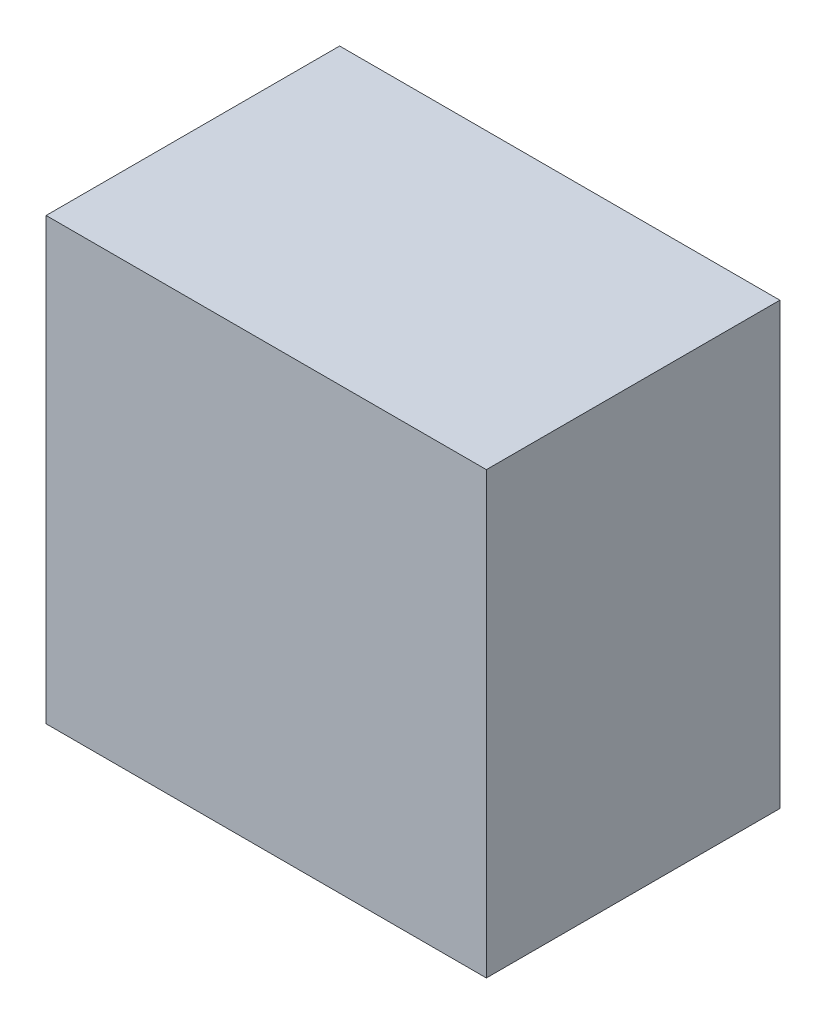
ISO-10303-21;
HEADER;
FILE_DESCRIPTION(('STEP AP214'),'2;1');
FILE_NAME('part.step','',(''),(''),'','','');
FILE_SCHEMA(('AUTOMOTIVE_DESIGN { 1 0 10303 214 1 1 1 1 }'));
ENDSEC;
DATA;
#1=APPLICATION_CONTEXT('core data for automotive mechanical design processes');
#2=APPLICATION_PROTOCOL_DEFINITION('international standard','automotive_design',2000,#1);
#3=PRODUCT_CONTEXT('',#1,'mechanical');
#4=PRODUCT('Part','Part','',(#3));
#5=PRODUCT_RELATED_PRODUCT_CATEGORY('part','',(#4));
#6=PRODUCT_DEFINITION_FORMATION('','',#4);
#7=PRODUCT_DEFINITION_CONTEXT('part definition',#1,'design');
#8=PRODUCT_DEFINITION('design','',#6,#7);
#9=PRODUCT_DEFINITION_SHAPE('','',#8);
#10=(LENGTH_UNIT() NAMED_UNIT(*) SI_UNIT(.MILLI.,.METRE.));
#11=(NAMED_UNIT(*) PLANE_ANGLE_UNIT() SI_UNIT($,.RADIAN.));
#12=(NAMED_UNIT(*) SI_UNIT($,.STERADIAN.) SOLID_ANGLE_UNIT());
#13=UNCERTAINTY_MEASURE_WITH_UNIT(LENGTH_MEASURE(1.E-05),#10,'distance_accuracy_value','');
#14=(GEOMETRIC_REPRESENTATION_CONTEXT(3) GLOBAL_UNCERTAINTY_ASSIGNED_CONTEXT((#13)) GLOBAL_UNIT_ASSIGNED_CONTEXT((#10,
#11,#12)) REPRESENTATION_CONTEXT('',''));
#15=CARTESIAN_POINT('',(0.,0.,0.));
#16=DIRECTION('',(0.,0.,1.));
#17=DIRECTION('',(1.,0.,0.));
#18=AXIS2_PLACEMENT_3D('',#15,#16,#17);
#19=CARTESIAN_POINT('',(0.,0.,20.));
#20=DIRECTION('',(1.,0.,0.));
#21=DIRECTION('',(0.,0.,-1.));
#22=AXIS2_PLACEMENT_3D('',#19,#20,#21);
#23=PLANE('',#22);
#24=DIRECTION('',(0.,-1.,0.));
#25=VECTOR('',#24,1.);
#26=CARTESIAN_POINT('',(0.,0.,0.));
#27=LINE('',#26,#25);
#28=CARTESIAN_POINT('',(0.,30.,0.));
#29=VERTEX_POINT('',#28);
#30=CARTESIAN_POINT('',(0.,0.,0.));
#31=VERTEX_POINT('',#30);
#32=EDGE_CURVE('E96',#29,#31,#27,.T.);
#33=ORIENTED_EDGE('',*,*,#32,.T.);
#34=DIRECTION('',(0.,0.,-1.));
#35=VECTOR('',#34,1.);
#36=CARTESIAN_POINT('',(0.,0.,20.));
#37=LINE('',#36,#35);
#38=CARTESIAN_POINT('',(0.,0.,20.));
#39=VERTEX_POINT('',#38);
#40=EDGE_CURVE('E11',#39,#31,#37,.T.);
#41=ORIENTED_EDGE('',*,*,#40,.F.);
#42=DIRECTION('',(0.,-1.,0.));
#43=VECTOR('',#42,1.);
#44=CARTESIAN_POINT('',(0.,0.,20.));
#45=LINE('',#44,#43);
#46=CARTESIAN_POINT('',(0.,30.,20.));
#47=VERTEX_POINT('',#46);
#48=EDGE_CURVE('E84',#47,#39,#45,.T.);
#49=ORIENTED_EDGE('',*,*,#48,.F.);
#50=DIRECTION('',(0.,0.,-1.));
#51=VECTOR('',#50,1.);
#52=CARTESIAN_POINT('',(0.,30.,20.));
#53=LINE('',#52,#51);
#54=EDGE_CURVE('E92',#47,#29,#53,.T.);
#55=ORIENTED_EDGE('',*,*,#54,.T.);
#56=EDGE_LOOP('',(#33,#41,#49,#55));
#57=FACE_BOUND('',#56,.T.);
#58=ADVANCED_FACE('F33',(#57),#23,.F.);
#59=CARTESIAN_POINT('',(0.,0.,20.));
#60=DIRECTION('',(0.,1.,0.));
#61=DIRECTION('',(0.,0.,1.));
#62=AXIS2_PLACEMENT_3D('',#59,#60,#61);
#63=PLANE('',#62);
#64=DIRECTION('',(1.,0.,0.));
#65=VECTOR('',#64,1.);
#66=CARTESIAN_POINT('',(0.,0.,0.));
#67=LINE('',#66,#65);
#68=CARTESIAN_POINT('',(30.,0.,0.));
#69=VERTEX_POINT('',#68);
#70=EDGE_CURVE('E88',#31,#69,#67,.T.);
#71=ORIENTED_EDGE('',*,*,#70,.T.);
#72=DIRECTION('',(0.,0.,-1.));
#73=VECTOR('',#72,1.);
#74=CARTESIAN_POINT('',(30.,0.,20.));
#75=LINE('',#74,#73);
#76=CARTESIAN_POINT('',(30.,0.,20.));
#77=VERTEX_POINT('',#76);
#78=EDGE_CURVE('E41',#77,#69,#75,.T.);
#79=ORIENTED_EDGE('',*,*,#78,.F.);
#80=DIRECTION('',(1.,0.,0.));
#81=VECTOR('',#80,1.);
#82=CARTESIAN_POINT('',(0.,0.,20.));
#83=LINE('',#82,#81);
#84=EDGE_CURVE('E79',#39,#77,#83,.T.);
#85=ORIENTED_EDGE('',*,*,#84,.F.);
#86=ORIENTED_EDGE('',*,*,#40,.T.);
#87=EDGE_LOOP('',(#71,#79,#85,#86));
#88=FACE_BOUND('',#87,.T.);
#89=ADVANCED_FACE('F87',(#88),#63,.F.);
#90=CARTESIAN_POINT('',(30.,0.,20.));
#91=DIRECTION('',(-1.,0.,0.));
#92=DIRECTION('',(0.,0.,1.));
#93=AXIS2_PLACEMENT_3D('',#90,#91,#92);
#94=PLANE('',#93);
#95=DIRECTION('',(0.,1.,0.));
#96=VECTOR('',#95,1.);
#97=CARTESIAN_POINT('',(30.,0.,0.));
#98=LINE('',#97,#96);
#99=CARTESIAN_POINT('',(30.,30.,0.));
#100=VERTEX_POINT('',#99);
#101=EDGE_CURVE('E66',#69,#100,#98,.T.);
#102=ORIENTED_EDGE('',*,*,#101,.T.);
#103=DIRECTION('',(0.,0.,-1.));
#104=VECTOR('',#103,1.);
#105=CARTESIAN_POINT('',(30.,30.,20.));
#106=LINE('',#105,#104);
#107=CARTESIAN_POINT('',(30.,30.,20.));
#108=VERTEX_POINT('',#107);
#109=EDGE_CURVE('E89',#108,#100,#106,.T.);
#110=ORIENTED_EDGE('',*,*,#109,.F.);
#111=DIRECTION('',(0.,1.,0.));
#112=VECTOR('',#111,1.);
#113=CARTESIAN_POINT('',(30.,0.,20.));
#114=LINE('',#113,#112);
#115=EDGE_CURVE('E82',#77,#108,#114,.T.);
#116=ORIENTED_EDGE('',*,*,#115,.F.);
#117=ORIENTED_EDGE('',*,*,#78,.T.);
#118=EDGE_LOOP('',(#102,#110,#116,#117));
#119=FACE_BOUND('',#118,.T.);
#120=ADVANCED_FACE('F90',(#119),#94,.F.);
#121=CARTESIAN_POINT('',(0.,30.,20.));
#122=DIRECTION('',(0.,-1.,0.));
#123=DIRECTION('',(0.,0.,-1.));
#124=AXIS2_PLACEMENT_3D('',#121,#122,#123);
#125=PLANE('',#124);
#126=DIRECTION('',(-1.,0.,0.));
#127=VECTOR('',#126,1.);
#128=CARTESIAN_POINT('',(0.,30.,0.));
#129=LINE('',#128,#127);
#130=EDGE_CURVE('E72',#100,#29,#129,.T.);
#131=ORIENTED_EDGE('',*,*,#130,.T.);
#132=ORIENTED_EDGE('',*,*,#54,.F.);
#133=DIRECTION('',(-1.,0.,0.));
#134=VECTOR('',#133,1.);
#135=CARTESIAN_POINT('',(0.,30.,20.));
#136=LINE('',#135,#134);
#137=EDGE_CURVE('E49',#108,#47,#136,.T.);
#138=ORIENTED_EDGE('',*,*,#137,.F.);
#139=ORIENTED_EDGE('',*,*,#109,.T.);
#140=EDGE_LOOP('',(#131,#132,#138,#139));
#141=FACE_BOUND('',#140,.T.);
#142=ADVANCED_FACE('F103',(#141),#125,.F.);
#143=CARTESIAN_POINT('',(0.,30.,20.));
#144=DIRECTION('',(0.,0.,-1.));
#145=DIRECTION('',(-1.,0.,0.));
#146=AXIS2_PLACEMENT_3D('',#143,#144,#145);
#147=PLANE('',#146);
#148=ORIENTED_EDGE('',*,*,#48,.T.);
#149=ORIENTED_EDGE('',*,*,#84,.T.);
#150=ORIENTED_EDGE('',*,*,#115,.T.);
#151=ORIENTED_EDGE('',*,*,#137,.T.);
#152=EDGE_LOOP('',(#148,#149,#150,#151));
#153=FACE_BOUND('',#152,.T.);
#154=ADVANCED_FACE('F80',(#153),#147,.F.);
#155=CARTESIAN_POINT('',(0.,30.,0.));
#156=DIRECTION('',(0.,0.,-1.));
#157=DIRECTION('',(-1.,0.,0.));
#158=AXIS2_PLACEMENT_3D('',#155,#156,#157);
#159=PLANE('',#158);
#160=ORIENTED_EDGE('',*,*,#32,.F.);
#161=ORIENTED_EDGE('',*,*,#130,.F.);
#162=ORIENTED_EDGE('',*,*,#101,.F.);
#163=ORIENTED_EDGE('',*,*,#70,.F.);
#164=EDGE_LOOP('',(#160,#161,#162,#163));
#165=FACE_BOUND('',#164,.T.);
#166=ADVANCED_FACE('F106',(#165),#159,.T.);
#167=CLOSED_SHELL('',(#58,#89,#120,#142,#154,#166));
#168=MANIFOLD_SOLID_BREP('B2',#167);
#169=ADVANCED_BREP_SHAPE_REPRESENTATION('',(#18,#168),#14);
#170=SHAPE_DEFINITION_REPRESENTATION(#9,#169);
ENDSEC;
END-ISO-10303-21;
